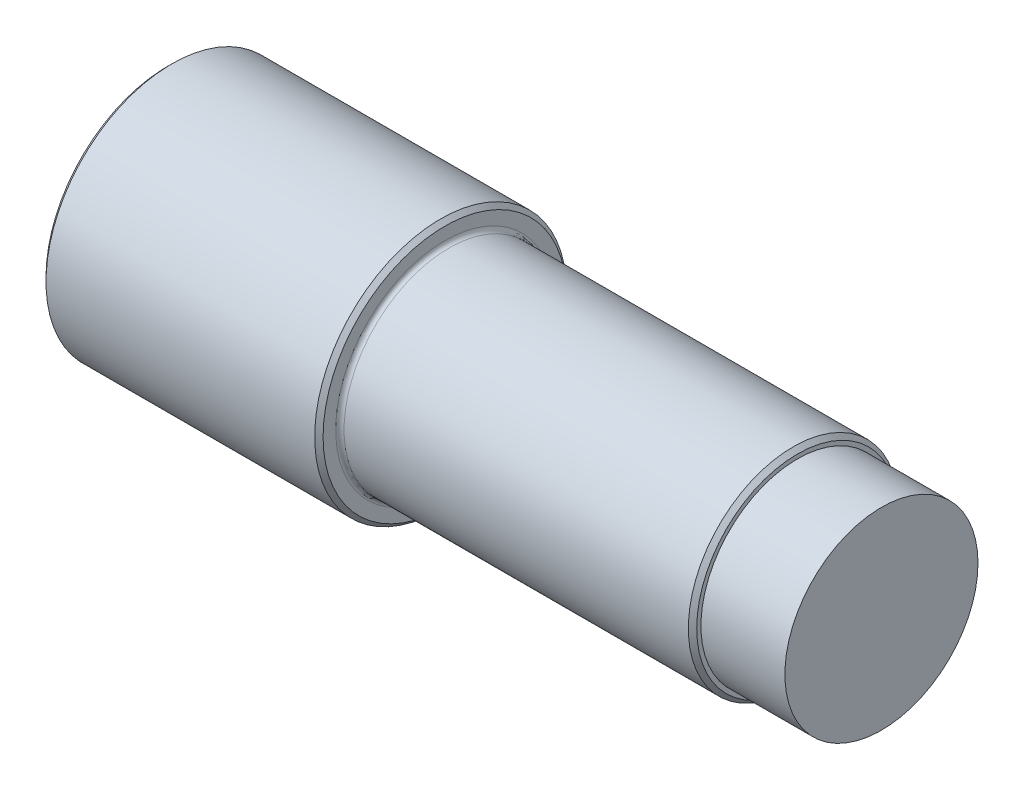
ISO-10303-21;
HEADER;
FILE_DESCRIPTION(('STEP AP214'),'2;1');
FILE_NAME('part.step','',(''),(''),'','','');
FILE_SCHEMA(('AUTOMOTIVE_DESIGN { 1 0 10303 214 1 1 1 1 }'));
ENDSEC;
DATA;
#1=APPLICATION_CONTEXT('core data for automotive mechanical design processes');
#2=APPLICATION_PROTOCOL_DEFINITION('international standard','automotive_design',2000,#1);
#3=PRODUCT_CONTEXT('',#1,'mechanical');
#4=PRODUCT('Part','Part','',(#3));
#5=PRODUCT_RELATED_PRODUCT_CATEGORY('part','',(#4));
#6=PRODUCT_DEFINITION_FORMATION('','',#4);
#7=PRODUCT_DEFINITION_CONTEXT('part definition',#1,'design');
#8=PRODUCT_DEFINITION('design','',#6,#7);
#9=PRODUCT_DEFINITION_SHAPE('','',#8);
#10=(LENGTH_UNIT() NAMED_UNIT(*) SI_UNIT(.MILLI.,.METRE.));
#11=(NAMED_UNIT(*) PLANE_ANGLE_UNIT() SI_UNIT($,.RADIAN.));
#12=(NAMED_UNIT(*) SI_UNIT($,.STERADIAN.) SOLID_ANGLE_UNIT());
#13=UNCERTAINTY_MEASURE_WITH_UNIT(LENGTH_MEASURE(1.E-05),#10,'distance_accuracy_value','');
#14=(GEOMETRIC_REPRESENTATION_CONTEXT(3) GLOBAL_UNCERTAINTY_ASSIGNED_CONTEXT((#13)) GLOBAL_UNIT_ASSIGNED_CONTEXT((#10,
#11,#12)) REPRESENTATION_CONTEXT('',''));
#15=CARTESIAN_POINT('',(0.,0.,0.));
#16=DIRECTION('',(0.,0.,1.));
#17=DIRECTION('',(1.,0.,0.));
#18=AXIS2_PLACEMENT_3D('',#15,#16,#17);
#19=CARTESIAN_POINT('',(33.,0.,0.));
#20=DIRECTION('',(-1.,0.,0.));
#21=DIRECTION('',(0.,0.,1.));
#22=AXIS2_PLACEMENT_3D('',#19,#20,#21);
#23=CYLINDRICAL_SURFACE('',#22,15.);
#24=CARTESIAN_POINT('',(32.5,0.,0.));
#25=DIRECTION('',(1.,0.,0.));
#26=DIRECTION('',(0.,0.,-1.));
#27=AXIS2_PLACEMENT_3D('',#24,#25,#26);
#28=CIRCLE('',#27,15.);
#29=CARTESIAN_POINT('',(32.5,0.,-15.));
#30=VERTEX_POINT('',#29);
#31=EDGE_CURVE('E44',#30,#30,#28,.F.);
#32=ORIENTED_EDGE('',*,*,#31,.T.);
#33=EDGE_LOOP('',(#32));
#34=FACE_BOUND('',#33,.T.);
#35=CARTESIAN_POINT('',(0.5,0.,0.));
#36=DIRECTION('',(1.,0.,0.));
#37=DIRECTION('',(0.,0.,-1.));
#38=AXIS2_PLACEMENT_3D('',#35,#36,#37);
#39=CIRCLE('',#38,15.);
#40=CARTESIAN_POINT('',(0.5,0.,-15.));
#41=VERTEX_POINT('',#40);
#42=EDGE_CURVE('E63',#41,#41,#39,.T.);
#43=ORIENTED_EDGE('',*,*,#42,.T.);
#44=EDGE_LOOP('',(#43));
#45=FACE_BOUND('',#44,.T.);
#46=ADVANCED_FACE('F32',(#34,#45),#23,.T.);
#47=CARTESIAN_POINT('',(33.,0.,0.));
#48=DIRECTION('',(1.,0.,0.));
#49=DIRECTION('',(0.,0.,-1.));
#50=AXIS2_PLACEMENT_3D('',#47,#48,#49);
#51=PLANE('',#50);
#52=CARTESIAN_POINT('',(33.,0.,0.));
#53=DIRECTION('',(1.,0.,0.));
#54=DIRECTION('',(0.,0.,-1.));
#55=AXIS2_PLACEMENT_3D('',#52,#53,#54);
#56=CIRCLE('',#55,14.5);
#57=CARTESIAN_POINT('',(33.,0.,-14.5));
#58=VERTEX_POINT('',#57);
#59=EDGE_CURVE('E60',#58,#58,#56,.T.);
#60=ORIENTED_EDGE('',*,*,#59,.T.);
#61=EDGE_LOOP('',(#60));
#62=FACE_BOUND('',#61,.T.);
#63=CARTESIAN_POINT('',(33.,0.,0.));
#64=DIRECTION('',(1.,0.,0.));
#65=DIRECTION('',(0.,0.,-1.));
#66=AXIS2_PLACEMENT_3D('',#63,#64,#65);
#67=CIRCLE('',#66,13.);
#68=CARTESIAN_POINT('',(33.,0.,-13.));
#69=VERTEX_POINT('',#68);
#70=EDGE_CURVE('E51',#69,#69,#67,.F.);
#71=ORIENTED_EDGE('',*,*,#70,.T.);
#72=EDGE_LOOP('',(#71));
#73=FACE_BOUND('',#72,.T.);
#74=ADVANCED_FACE('F76',(#62,#73),#51,.T.);
#75=CARTESIAN_POINT('',(0.,0.,0.));
#76=DIRECTION('',(1.,0.,0.));
#77=DIRECTION('',(0.,0.,-1.));
#78=AXIS2_PLACEMENT_3D('',#75,#76,#77);
#79=PLANE('',#78);
#80=CARTESIAN_POINT('',(0.,0.,0.));
#81=DIRECTION('',(1.,0.,0.));
#82=DIRECTION('',(0.,0.,-1.));
#83=AXIS2_PLACEMENT_3D('',#80,#81,#82);
#84=CIRCLE('',#83,14.5);
#85=CARTESIAN_POINT('',(0.,0.,-14.5));
#86=VERTEX_POINT('',#85);
#87=EDGE_CURVE('E36',#86,#86,#84,.F.);
#88=ORIENTED_EDGE('',*,*,#87,.T.);
#89=EDGE_LOOP('',(#88));
#90=FACE_BOUND('',#89,.T.);
#91=ADVANCED_FACE('F79',(#90),#79,.F.);
#92=CARTESIAN_POINT('',(75.,0.,0.));
#93=DIRECTION('',(-1.,0.,0.));
#94=DIRECTION('',(0.,0.,1.));
#95=AXIS2_PLACEMENT_3D('',#92,#93,#94);
#96=CYLINDRICAL_SURFACE('',#95,12.5);
#97=CARTESIAN_POINT('',(74.5,0.,0.));
#98=DIRECTION('',(1.,0.,0.));
#99=DIRECTION('',(0.,0.,-1.));
#100=AXIS2_PLACEMENT_3D('',#97,#98,#99);
#101=CIRCLE('',#100,12.5);
#102=CARTESIAN_POINT('',(74.5,0.,-12.5));
#103=VERTEX_POINT('',#102);
#104=EDGE_CURVE('E57',#103,#103,#101,.F.);
#105=ORIENTED_EDGE('',*,*,#104,.T.);
#106=EDGE_LOOP('',(#105));
#107=FACE_BOUND('',#106,.T.);
#108=CARTESIAN_POINT('',(33.5,0.,0.));
#109=DIRECTION('',(1.,0.,0.));
#110=DIRECTION('',(0.,0.,-1.));
#111=AXIS2_PLACEMENT_3D('',#108,#109,#110);
#112=CIRCLE('',#111,12.5);
#113=CARTESIAN_POINT('',(33.5,0.,-12.5));
#114=VERTEX_POINT('',#113);
#115=EDGE_CURVE('E48',#114,#114,#112,.T.);
#116=ORIENTED_EDGE('',*,*,#115,.T.);
#117=EDGE_LOOP('',(#116));
#118=FACE_BOUND('',#117,.T.);
#119=ADVANCED_FACE('F90',(#107,#118),#96,.T.);
#120=CARTESIAN_POINT('',(75.,0.,0.));
#121=DIRECTION('',(1.,0.,0.));
#122=DIRECTION('',(0.,0.,-1.));
#123=AXIS2_PLACEMENT_3D('',#120,#121,#122);
#124=PLANE('',#123);
#125=CARTESIAN_POINT('',(75.,0.,0.));
#126=DIRECTION('',(1.,0.,0.));
#127=DIRECTION('',(0.,0.,-1.));
#128=AXIS2_PLACEMENT_3D('',#125,#126,#127);
#129=CIRCLE('',#128,11.5);
#130=CARTESIAN_POINT('',(75.,0.,-11.5));
#131=VERTEX_POINT('',#130);
#132=EDGE_CURVE('E10',#131,#131,#129,.T.);
#133=ORIENTED_EDGE('',*,*,#132,.F.);
#134=EDGE_LOOP('',(#133));
#135=FACE_BOUND('',#134,.T.);
#136=CARTESIAN_POINT('',(75.,0.,0.));
#137=DIRECTION('',(1.,0.,0.));
#138=DIRECTION('',(0.,0.,-1.));
#139=AXIS2_PLACEMENT_3D('',#136,#137,#138);
#140=CIRCLE('',#139,12.);
#141=CARTESIAN_POINT('',(75.,0.,-12.));
#142=VERTEX_POINT('',#141);
#143=EDGE_CURVE('E54',#142,#142,#140,.T.);
#144=ORIENTED_EDGE('',*,*,#143,.T.);
#145=EDGE_LOOP('',(#144));
#146=FACE_BOUND('',#145,.T.);
#147=ADVANCED_FACE('F86',(#135,#146),#124,.T.);
#148=CARTESIAN_POINT('',(33.5,0.,0.));
#149=DIRECTION('',(1.,0.,0.));
#150=DIRECTION('',(0.,0.,-1.));
#151=AXIS2_PLACEMENT_3D('',#148,#149,#150);
#152=TOROIDAL_SURFACE('',#151,13.,0.5);
#153=ORIENTED_EDGE('',*,*,#70,.F.);
#154=EDGE_LOOP('',(#153));
#155=FACE_BOUND('',#154,.T.);
#156=ORIENTED_EDGE('',*,*,#115,.F.);
#157=EDGE_LOOP('',(#156));
#158=FACE_BOUND('',#157,.T.);
#159=ADVANCED_FACE('F83',(#155,#158),#152,.F.);
#160=CARTESIAN_POINT('',(75.,0.,0.));
#161=DIRECTION('',(-1.,0.,0.));
#162=DIRECTION('',(0.,0.,1.));
#163=AXIS2_PLACEMENT_3D('',#160,#161,#162);
#164=CONICAL_SURFACE('',#163,12.,0.785398163397428);
#165=ORIENTED_EDGE('',*,*,#104,.F.);
#166=EDGE_LOOP('',(#165));
#167=FACE_BOUND('',#166,.T.);
#168=ORIENTED_EDGE('',*,*,#143,.F.);
#169=EDGE_LOOP('',(#168));
#170=FACE_BOUND('',#169,.T.);
#171=ADVANCED_FACE('F73',(#167,#170),#164,.T.);
#172=CARTESIAN_POINT('',(33.,0.,0.));
#173=DIRECTION('',(-1.,0.,0.));
#174=DIRECTION('',(0.,0.,1.));
#175=AXIS2_PLACEMENT_3D('',#172,#173,#174);
#176=CONICAL_SURFACE('',#175,14.5,0.785398163397452);
#177=ORIENTED_EDGE('',*,*,#31,.F.);
#178=EDGE_LOOP('',(#177));
#179=FACE_BOUND('',#178,.T.);
#180=ORIENTED_EDGE('',*,*,#59,.F.);
#181=EDGE_LOOP('',(#180));
#182=FACE_BOUND('',#181,.T.);
#183=ADVANCED_FACE('F70',(#179,#182),#176,.T.);
#184=CARTESIAN_POINT('',(0.5,0.,0.));
#185=DIRECTION('',(1.,0.,0.));
#186=DIRECTION('',(0.,0.,-1.));
#187=AXIS2_PLACEMENT_3D('',#184,#185,#186);
#188=CONICAL_SURFACE('',#187,15.,0.785398163397445);
#189=ORIENTED_EDGE('',*,*,#87,.F.);
#190=EDGE_LOOP('',(#189));
#191=FACE_BOUND('',#190,.T.);
#192=ORIENTED_EDGE('',*,*,#42,.F.);
#193=EDGE_LOOP('',(#192));
#194=FACE_BOUND('',#193,.T.);
#195=ADVANCED_FACE('F34',(#191,#194),#188,.T.);
#196=CARTESIAN_POINT('',(85.,0.,0.));
#197=DIRECTION('',(-1.,0.,0.));
#198=DIRECTION('',(0.,0.,1.));
#199=AXIS2_PLACEMENT_3D('',#196,#197,#198);
#200=CYLINDRICAL_SURFACE('',#199,11.5);
#201=CARTESIAN_POINT('',(85.,0.,0.));
#202=DIRECTION('',(1.,0.,0.));
#203=DIRECTION('',(0.,0.,-1.));
#204=AXIS2_PLACEMENT_3D('',#201,#202,#203);
#205=CIRCLE('',#204,11.5);
#206=CARTESIAN_POINT('',(85.,0.,-11.5));
#207=VERTEX_POINT('',#206);
#208=EDGE_CURVE('E47',#207,#207,#205,.T.);
#209=ORIENTED_EDGE('',*,*,#208,.F.);
#210=EDGE_LOOP('',(#209));
#211=FACE_BOUND('',#210,.T.);
#212=ORIENTED_EDGE('',*,*,#132,.T.);
#213=EDGE_LOOP('',(#212));
#214=FACE_BOUND('',#213,.T.);
#215=ADVANCED_FACE('F127',(#211,#214),#200,.T.);
#216=CARTESIAN_POINT('',(85.,0.,0.));
#217=DIRECTION('',(1.,0.,0.));
#218=DIRECTION('',(0.,0.,-1.));
#219=AXIS2_PLACEMENT_3D('',#216,#217,#218);
#220=PLANE('',#219);
#221=ORIENTED_EDGE('',*,*,#208,.T.);
#222=EDGE_LOOP('',(#221));
#223=FACE_BOUND('',#222,.T.);
#224=ADVANCED_FACE('F135',(#223),#220,.T.);
#225=CLOSED_SHELL('',(#46,#74,#91,#119,#147,#159,#171,#183,#195,#215,#224));
#226=MANIFOLD_SOLID_BREP('B2',#225);
#227=ADVANCED_BREP_SHAPE_REPRESENTATION('',(#18,#226),#14);
#228=SHAPE_DEFINITION_REPRESENTATION(#9,#227);
ENDSEC;
END-ISO-10303-21;
